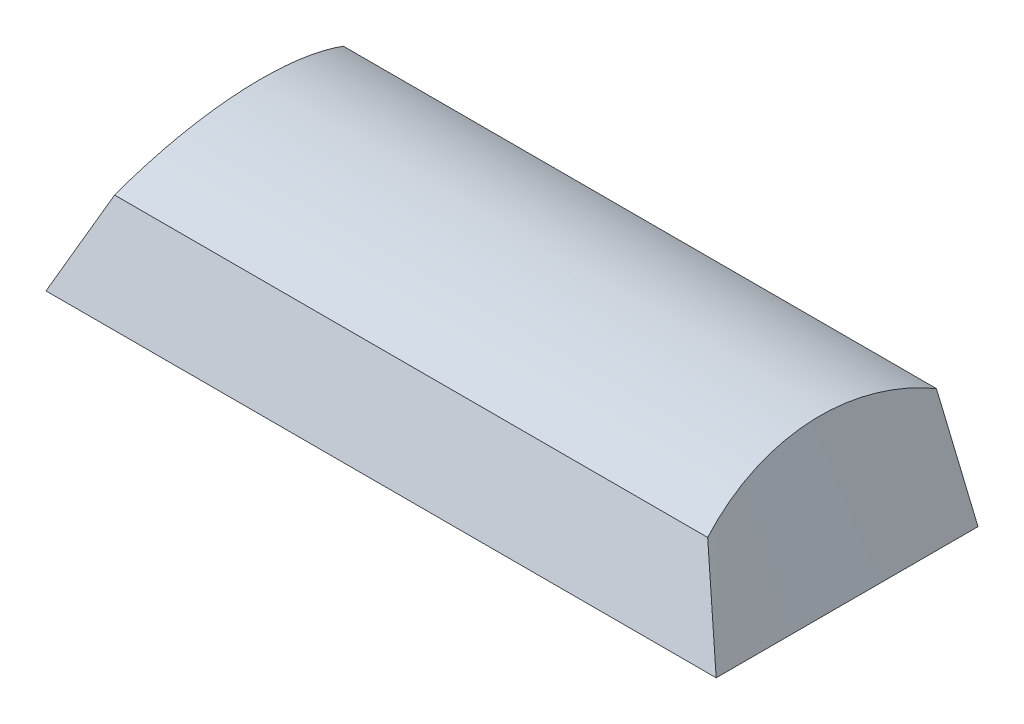
ISO-10303-21;
HEADER;
FILE_DESCRIPTION(('STEP AP214'),'2;1');
FILE_NAME('part.step','',(''),(''),'','','');
FILE_SCHEMA(('AUTOMOTIVE_DESIGN { 1 0 10303 214 1 1 1 1 }'));
ENDSEC;
DATA;
#1=APPLICATION_CONTEXT('core data for automotive mechanical design processes');
#2=APPLICATION_PROTOCOL_DEFINITION('international standard','automotive_design',2000,#1);
#3=PRODUCT_CONTEXT('',#1,'mechanical');
#4=PRODUCT('Part','Part','',(#3));
#5=PRODUCT_RELATED_PRODUCT_CATEGORY('part','',(#4));
#6=PRODUCT_DEFINITION_FORMATION('','',#4);
#7=PRODUCT_DEFINITION_CONTEXT('part definition',#1,'design');
#8=PRODUCT_DEFINITION('design','',#6,#7);
#9=PRODUCT_DEFINITION_SHAPE('','',#8);
#10=(LENGTH_UNIT() NAMED_UNIT(*) SI_UNIT(.MILLI.,.METRE.));
#11=(NAMED_UNIT(*) PLANE_ANGLE_UNIT() SI_UNIT($,.RADIAN.));
#12=(NAMED_UNIT(*) SI_UNIT($,.STERADIAN.) SOLID_ANGLE_UNIT());
#13=UNCERTAINTY_MEASURE_WITH_UNIT(LENGTH_MEASURE(1.E-05),#10,'distance_accuracy_value','');
#14=(GEOMETRIC_REPRESENTATION_CONTEXT(3) GLOBAL_UNCERTAINTY_ASSIGNED_CONTEXT((#13)) GLOBAL_UNIT_ASSIGNED_CONTEXT((#10,
#11,#12)) REPRESENTATION_CONTEXT('',''));
#15=CARTESIAN_POINT('',(0.,0.,0.));
#16=DIRECTION('',(0.,0.,1.));
#17=DIRECTION('',(1.,0.,0.));
#18=AXIS2_PLACEMENT_3D('',#15,#16,#17);
#19=CARTESIAN_POINT('',(0.,0.266878681091861,-8.99207922565694));
#20=DIRECTION('',(0.,0.0296662440851145,-0.999559860119384));
#21=DIRECTION('',(0.,0.999559860119384,0.0296662440851145));
#22=AXIS2_PLACEMENT_3D('',#19,#20,#21);
#23=PLANE('',#22);
#24=DIRECTION('',(-0.353913717444489,0.934866423438274,0.0277461877084434));
#25=VECTOR('',#24,1.);
#26=CARTESIAN_POINT('',(20.385,7.,-8.79224485007731));
#27=LINE('',#26,#25);
#28=CARTESIAN_POINT('',(23.035,0.,-9.));
#29=VERTEX_POINT('',#28);
#30=CARTESIAN_POINT('',(20.385,7.,-8.79224485007731));
#31=VERTEX_POINT('',#30);
#32=EDGE_CURVE('E131',#29,#31,#27,.T.);
#33=ORIENTED_EDGE('',*,*,#32,.F.);
#34=DIRECTION('',(1.,0.,0.));
#35=VECTOR('',#34,1.);
#36=CARTESIAN_POINT('',(23.035,0.,-9.));
#37=LINE('',#36,#35);
#38=CARTESIAN_POINT('',(-23.035,0.,-9.));
#39=VERTEX_POINT('',#38);
#40=EDGE_CURVE('E133',#39,#29,#37,.T.);
#41=ORIENTED_EDGE('',*,*,#40,.F.);
#42=DIRECTION('',(-0.35391371744449,-0.934866423438274,-0.0277461877084434));
#43=VECTOR('',#42,1.);
#44=CARTESIAN_POINT('',(-23.035,0.,-9.));
#45=LINE('',#44,#43);
#46=CARTESIAN_POINT('',(-20.385,7.,-8.79224485007731));
#47=VERTEX_POINT('',#46);
#48=EDGE_CURVE('E69',#47,#39,#45,.T.);
#49=ORIENTED_EDGE('',*,*,#48,.F.);
#50=DIRECTION('',(-1.,0.,0.));
#51=VECTOR('',#50,1.);
#52=CARTESIAN_POINT('',(20.385,7.,-8.79224485007731));
#53=LINE('',#52,#51);
#54=EDGE_CURVE('E13',#31,#47,#53,.T.);
#55=ORIENTED_EDGE('',*,*,#54,.F.);
#56=EDGE_LOOP('',(#33,#41,#49,#55));
#57=FACE_BOUND('',#56,.T.);
#58=ADVANCED_FACE('F59',(#57),#23,.T.);
#59=CARTESIAN_POINT('',(0.,2.77047663896547,8.04604839123025));
#60=DIRECTION('',(0.,0.325568154457157,0.945518575599317));
#61=DIRECTION('',(0.,-0.945518575599317,0.325568154457157));
#62=AXIS2_PLACEMENT_3D('',#59,#60,#61);
#63=PLANE('',#62);
#64=DIRECTION('',(-0.385352284096955,-0.87249573757801,0.300424374925643));
#65=VECTOR('',#64,1.);
#66=CARTESIAN_POINT('',(-20.385,6.,6.93403432026201));
#67=LINE('',#66,#65);
#68=CARTESIAN_POINT('',(-20.385,6.,6.93403432026201));
#69=VERTEX_POINT('',#68);
#70=CARTESIAN_POINT('',(-23.035,0.,9.));
#71=VERTEX_POINT('',#70);
#72=EDGE_CURVE('E109',#69,#71,#67,.T.);
#73=ORIENTED_EDGE('',*,*,#72,.T.);
#74=DIRECTION('',(1.,0.,0.));
#75=VECTOR('',#74,1.);
#76=CARTESIAN_POINT('',(-23.035,0.,9.));
#77=LINE('',#76,#75);
#78=CARTESIAN_POINT('',(23.035,0.,9.));
#79=VERTEX_POINT('',#78);
#80=EDGE_CURVE('E125',#71,#79,#77,.T.);
#81=ORIENTED_EDGE('',*,*,#80,.T.);
#82=DIRECTION('',(-0.385352284096955,0.87249573757801,-0.300424374925643));
#83=VECTOR('',#82,1.);
#84=CARTESIAN_POINT('',(23.035,0.,9.));
#85=LINE('',#84,#83);
#86=CARTESIAN_POINT('',(20.385,6.,6.93403432026201));
#87=VERTEX_POINT('',#86);
#88=EDGE_CURVE('E111',#79,#87,#85,.T.);
#89=ORIENTED_EDGE('',*,*,#88,.T.);
#90=DIRECTION('',(-1.,0.,0.));
#91=VECTOR('',#90,1.);
#92=CARTESIAN_POINT('',(-20.385,6.,6.93403432026201));
#93=LINE('',#92,#91);
#94=EDGE_CURVE('E105',#87,#69,#93,.T.);
#95=ORIENTED_EDGE('',*,*,#94,.T.);
#96=EDGE_LOOP('',(#73,#81,#89,#95));
#97=FACE_BOUND('',#96,.T.);
#98=ADVANCED_FACE('F107',(#97),#63,.T.);
#99=CARTESIAN_POINT('',(-23.035,0.,9.));
#100=CARTESIAN_POINT('',(-23.035,0.,3.));
#101=CARTESIAN_POINT('',(-23.035,0.,-3.));
#102=CARTESIAN_POINT('',(-23.035,0.,-9.));
#103=CARTESIAN_POINT('',(-22.8141666666667,0.500000000000002,8.82783619335517));
#104=CARTESIAN_POINT('',(-22.7292097793405,0.758483134882732,2.94105495386628));
#105=CARTESIAN_POINT('',(-22.7292097793405,0.790743508372074,-3.06628068576654));
#106=CARTESIAN_POINT('',(-22.8141666666667,0.583333333333335,-8.98268707083978));
#107=CARTESIAN_POINT('',(-22.3725,1.50000000000001,8.48350858006551));
#108=CARTESIAN_POINT('',(-22.1176293380214,2.27544940464819,2.82316486159884));
#109=CARTESIAN_POINT('',(-22.1176293380214,2.37223052511622,-3.19884205729961));
#110=CARTESIAN_POINT('',(-22.3725,1.75,-8.94806121251933));
#111=CARTESIAN_POINT('',(-21.71,2.99999999999999,7.96701716013099));
#112=CARTESIAN_POINT('',(-21.2002586760427,4.55089880929637,2.64632972319767));
#113=CARTESIAN_POINT('',(-21.2002586760427,4.74446105023243,-3.39768411459922));
#114=CARTESIAN_POINT('',(-21.71,3.5,-8.89612242503865));
#115=CARTESIAN_POINT('',(-21.0475,4.5,7.45052574019652));
#116=CARTESIAN_POINT('',(-20.2828880140641,6.82634821394457,2.46949458479652));
#117=CARTESIAN_POINT('',(-20.2828880140641,7.11669157534865,-3.59652617189883));
#118=CARTESIAN_POINT('',(-21.0475,5.25,-8.84418363755799));
#119=CARTESIAN_POINT('',(-20.6058333333333,5.5,7.10619812690684));
#120=CARTESIAN_POINT('',(-19.671307572745,8.34331448371002,2.35160449252908));
#121=CARTESIAN_POINT('',(-19.671307572745,8.69817859209279,-3.72908754343191));
#122=CARTESIAN_POINT('',(-20.6058333333333,6.41666666666667,-8.80955777923753));
#123=CARTESIAN_POINT('',(-20.385,6.,6.93403432026201));
#124=CARTESIAN_POINT('',(-19.3655173520855,9.10179761859276,2.29265944639536));
#125=CARTESIAN_POINT('',(-19.3655173520855,9.48892210046487,-3.79536822919844));
#126=CARTESIAN_POINT('',(-20.385,7.,-8.79224485007731));
#127=B_SPLINE_SURFACE_WITH_KNOTS('',3,3,((#99,#100,#101,#102),(#103,#104,#105,#106),(#107,#108,
#109,#110),(#111,#112,#113,#114),(#115,#116,#117,#118),(#119,#120,#121,#122),(#123,#124,#125,
#126)),.UNSPECIFIED.,.F.,.F.,.F.,(4,1,1,1,4),(4,4),(0.881179556856417,0.910884667642313,
0.940589778428208,0.970294889214104,1.),(0.,1.),.UNSPECIFIED.);
#128=CARTESIAN_POINT('',(-20.385,6.,6.93403432026201));
#129=CARTESIAN_POINT('',(-19.3655173520855,9.10179761859276,2.29265944639536));
#130=CARTESIAN_POINT('',(-19.3655173520855,9.48892210046487,-3.79536822919844));
#131=CARTESIAN_POINT('',(-20.385,7.,-8.79224485007731));
#132=B_SPLINE_CURVE_WITH_KNOTS('',3,(#128,#129,#130,#131),.UNSPECIFIED.,.F.,.F.,(4,4),(0.,1.),.UNSPECIFIED.);
#133=EDGE_CURVE('E77',#69,#47,#132,.T.);
#134=DIRECTION('',(0.,0.,-1.));
#135=VECTOR('',#134,1.);
#136=CARTESIAN_POINT('',(-23.035,0.,0.));
#137=LINE('',#136,#135);
#138=EDGE_CURVE('E124',#71,#39,#137,.T.);
#139=ORIENTED_EDGE('',*,*,#72,.F.);
#140=ORIENTED_EDGE('',*,*,#133,.T.);
#141=ORIENTED_EDGE('',*,*,#48,.T.);
#142=ORIENTED_EDGE('',*,*,#138,.F.);
#143=EDGE_LOOP('',(#139,#140,#141,#142));
#144=FACE_BOUND('',#143,.T.);
#145=ADVANCED_FACE('F122',(#144),#127,.T.);
#146=CARTESIAN_POINT('',(23.035,0.,9.));
#147=DIRECTION('',(0.,-1.,0.));
#148=DIRECTION('',(-1.,0.,0.));
#149=AXIS2_PLACEMENT_3D('',#146,#147,#148);
#150=PLANE('',#149);
#151=ORIENTED_EDGE('',*,*,#80,.F.);
#152=ORIENTED_EDGE('',*,*,#138,.T.);
#153=ORIENTED_EDGE('',*,*,#40,.T.);
#154=DIRECTION('',(0.,0.,-1.));
#155=VECTOR('',#154,1.);
#156=CARTESIAN_POINT('',(23.035,0.,0.));
#157=LINE('',#156,#155);
#158=EDGE_CURVE('E135',#79,#29,#157,.T.);
#159=ORIENTED_EDGE('',*,*,#158,.F.);
#160=EDGE_LOOP('',(#151,#152,#153,#159));
#161=FACE_BOUND('',#160,.T.);
#162=ADVANCED_FACE('F177',(#161),#150,.T.);
#163=CARTESIAN_POINT('',(20.385,6.,6.93403432026201));
#164=CARTESIAN_POINT('',(19.3655173520855,9.10179761859276,2.29265944639536));
#165=CARTESIAN_POINT('',(19.3655173520855,9.48892210046487,-3.79536822919843));
#166=CARTESIAN_POINT('',(20.385,7.,-8.79224485007731));
#167=CARTESIAN_POINT('',(20.6058333333333,5.5,7.10619812690684));
#168=CARTESIAN_POINT('',(19.671307572745,8.34331448371002,2.35160449252908));
#169=CARTESIAN_POINT('',(19.671307572745,8.6981785920928,-3.7290875434319));
#170=CARTESIAN_POINT('',(20.6058333333333,6.41666666666667,-8.80955777923754));
#171=CARTESIAN_POINT('',(21.0475,4.5,7.45052574019651));
#172=CARTESIAN_POINT('',(20.2828880140641,6.82634821394457,2.46949458479653));
#173=CARTESIAN_POINT('',(20.2828880140641,7.11669157534866,-3.59652617189882));
#174=CARTESIAN_POINT('',(21.0475,5.25000000000001,-8.84418363755799));
#175=CARTESIAN_POINT('',(21.71,3.,7.967017160131));
#176=CARTESIAN_POINT('',(21.2002586760428,4.55089880929638,2.64632972319768));
#177=CARTESIAN_POINT('',(21.2002586760428,4.74446105023244,-3.39768411459922));
#178=CARTESIAN_POINT('',(21.71,3.5,-8.89612242503866));
#179=CARTESIAN_POINT('',(22.3725,1.5,8.48350858006551));
#180=CARTESIAN_POINT('',(22.1176293380214,2.27544940464819,2.82316486159884));
#181=CARTESIAN_POINT('',(22.1176293380214,2.37223052511622,-3.19884205729961));
#182=CARTESIAN_POINT('',(22.3725,1.75,-8.94806121251933));
#183=CARTESIAN_POINT('',(22.8141666666667,0.5,8.82783619335517));
#184=CARTESIAN_POINT('',(22.7292097793405,0.758483134882729,2.94105495386628));
#185=CARTESIAN_POINT('',(22.7292097793405,0.790743508372071,-3.06628068576654));
#186=CARTESIAN_POINT('',(22.8141666666667,0.583333333333331,-8.98268707083978));
#187=CARTESIAN_POINT('',(23.035,0.,9.));
#188=CARTESIAN_POINT('',(23.035,0.,3.));
#189=CARTESIAN_POINT('',(23.035,0.,-3.));
#190=CARTESIAN_POINT('',(23.035,0.,-9.));
#191=B_SPLINE_SURFACE_WITH_KNOTS('',3,3,((#163,#164,#165,#166),(#167,#168,#169,#170),(#171,#172,
#173,#174),(#175,#176,#177,#178),(#179,#180,#181,#182),(#183,#184,#185,#186),(#187,#188,#189,
#190)),.UNSPECIFIED.,.F.,.F.,.F.,(4,1,1,1,4),(4,4),(0.,0.0297051107858958,0.0594102215717917,
0.0891153323576875,0.118820443143583),(0.,1.),.UNSPECIFIED.);
#192=CARTESIAN_POINT('',(20.385,6.,6.93403432026201));
#193=CARTESIAN_POINT('',(19.3655173520855,9.10179761859276,2.29265944639536));
#194=CARTESIAN_POINT('',(19.3655173520855,9.48892210046487,-3.79536822919843));
#195=CARTESIAN_POINT('',(20.385,7.,-8.79224485007731));
#196=B_SPLINE_CURVE_WITH_KNOTS('',3,(#192,#193,#194,#195),.UNSPECIFIED.,.F.,.F.,(4,4),(0.,1.),.UNSPECIFIED.);
#197=EDGE_CURVE('E116',#87,#31,#196,.T.);
#198=ORIENTED_EDGE('',*,*,#88,.F.);
#199=ORIENTED_EDGE('',*,*,#158,.T.);
#200=ORIENTED_EDGE('',*,*,#32,.T.);
#201=ORIENTED_EDGE('',*,*,#197,.F.);
#202=EDGE_LOOP('',(#198,#199,#200,#201));
#203=FACE_BOUND('',#202,.T.);
#204=ADVANCED_FACE('F165',(#203),#191,.T.);
#205=CARTESIAN_POINT('',(-20.385,6.,6.93403432026201));
#206=CARTESIAN_POINT('',(-19.3655173520855,9.10179761859276,2.29265944639536));
#207=CARTESIAN_POINT('',(-19.3655173520855,9.48892210046487,-3.79536822919844));
#208=CARTESIAN_POINT('',(-20.385,7.,-8.79224485007731));
#209=CARTESIAN_POINT('',(-6.795,6.,6.93403432026201));
#210=CARTESIAN_POINT('',(-6.45517245069516,9.10179761859276,2.29265944639536));
#211=CARTESIAN_POINT('',(-6.45517245069517,9.48892210046487,-3.79536822919844));
#212=CARTESIAN_POINT('',(-6.795,7.,-8.79224485007731));
#213=CARTESIAN_POINT('',(6.79499999999999,6.,6.93403432026201));
#214=CARTESIAN_POINT('',(6.45517245069517,9.10179761859276,2.29265944639536));
#215=CARTESIAN_POINT('',(6.45517245069517,9.48892210046487,-3.79536822919844));
#216=CARTESIAN_POINT('',(6.795,7.,-8.79224485007731));
#217=CARTESIAN_POINT('',(20.385,6.,6.93403432026201));
#218=CARTESIAN_POINT('',(19.3655173520855,9.10179761859276,2.29265944639536));
#219=CARTESIAN_POINT('',(19.3655173520855,9.48892210046487,-3.79536822919843));
#220=CARTESIAN_POINT('',(20.385,7.,-8.79224485007731));
#221=B_SPLINE_SURFACE_WITH_KNOTS('',3,3,((#205,#206,#207,#208),(#209,#210,#211,#212),(#213,#214,
#215,#216),(#217,#218,#219,#220)),.UNSPECIFIED.,.F.,.F.,.F.,(4,4),(4,4),(0.,1.),(0.,1.),.UNSPECIFIED.);
#222=ORIENTED_EDGE('',*,*,#94,.F.);
#223=ORIENTED_EDGE('',*,*,#197,.T.);
#224=ORIENTED_EDGE('',*,*,#54,.T.);
#225=ORIENTED_EDGE('',*,*,#133,.F.);
#226=EDGE_LOOP('',(#222,#223,#224,#225));
#227=FACE_BOUND('',#226,.T.);
#228=ADVANCED_FACE('F129',(#227),#221,.T.);
#229=CLOSED_SHELL('',(#58,#98,#145,#162,#204,#228));
#230=MANIFOLD_SOLID_BREP('B2',#229);
#231=ADVANCED_BREP_SHAPE_REPRESENTATION('',(#18,#230),#14);
#232=SHAPE_DEFINITION_REPRESENTATION(#9,#231);
ENDSEC;
END-ISO-10303-21;
